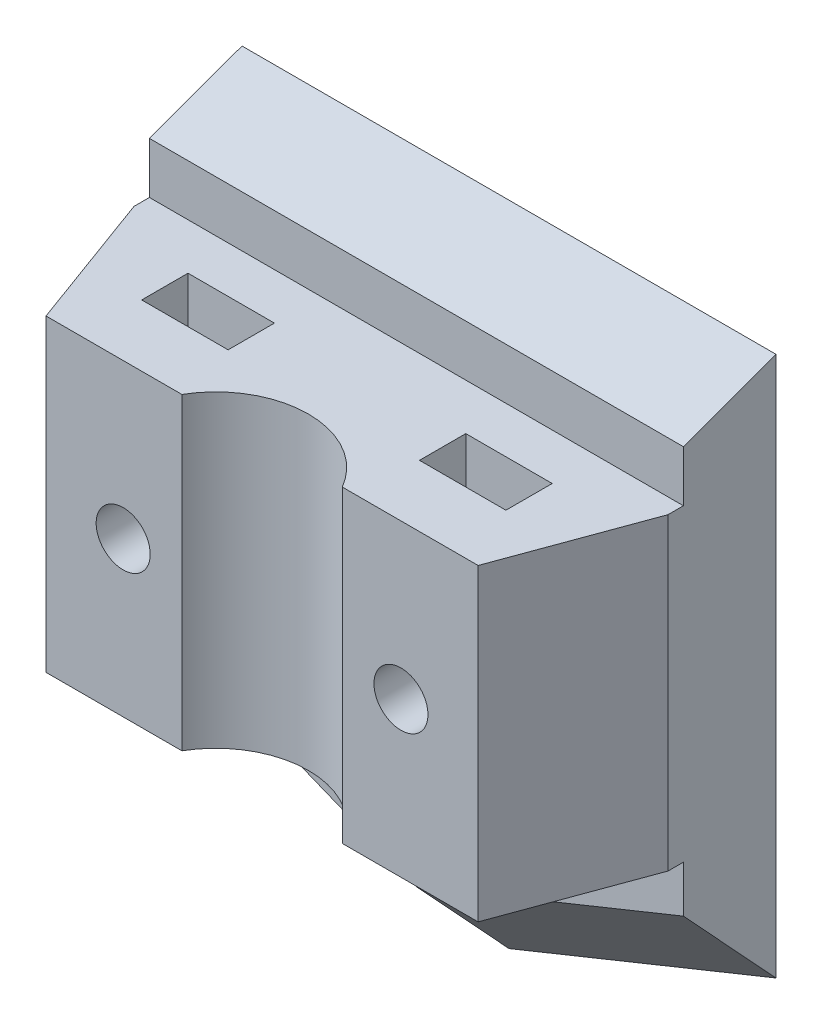
ISO-10303-21;
HEADER;
FILE_DESCRIPTION(('STEP AP214'),'2;1');
FILE_NAME('part.step','',(''),(''),'','','');
FILE_SCHEMA(('AUTOMOTIVE_DESIGN { 1 0 10303 214 1 1 1 1 }'));
ENDSEC;
DATA;
#1=APPLICATION_CONTEXT('core data for automotive mechanical design processes');
#2=APPLICATION_PROTOCOL_DEFINITION('international standard','automotive_design',2000,#1);
#3=PRODUCT_CONTEXT('',#1,'mechanical');
#4=PRODUCT('Part','Part','',(#3));
#5=PRODUCT_RELATED_PRODUCT_CATEGORY('part','',(#4));
#6=PRODUCT_DEFINITION_FORMATION('','',#4);
#7=PRODUCT_DEFINITION_CONTEXT('part definition',#1,'design');
#8=PRODUCT_DEFINITION('design','',#6,#7);
#9=PRODUCT_DEFINITION_SHAPE('','',#8);
#10=(LENGTH_UNIT() NAMED_UNIT(*) SI_UNIT(.MILLI.,.METRE.));
#11=(NAMED_UNIT(*) PLANE_ANGLE_UNIT() SI_UNIT($,.RADIAN.));
#12=(NAMED_UNIT(*) SI_UNIT($,.STERADIAN.) SOLID_ANGLE_UNIT());
#13=UNCERTAINTY_MEASURE_WITH_UNIT(LENGTH_MEASURE(1.E-05),#10,'distance_accuracy_value','');
#14=(GEOMETRIC_REPRESENTATION_CONTEXT(3) GLOBAL_UNCERTAINTY_ASSIGNED_CONTEXT((#13)) GLOBAL_UNIT_ASSIGNED_CONTEXT((#10,
#11,#12)) REPRESENTATION_CONTEXT('',''));
#15=CARTESIAN_POINT('',(0.,0.,0.));
#16=DIRECTION('',(0.,0.,1.));
#17=DIRECTION('',(1.,0.,0.));
#18=AXIS2_PLACEMENT_3D('',#15,#16,#17);
#19=CARTESIAN_POINT('',(0.,-26.5,0.));
#20=DIRECTION('',(0.265223828337456,0.655481747176855,-0.707106781186549));
#21=DIRECTION('',(-0.926991176745522,0.375083135099344,0.));
#22=AXIS2_PLACEMENT_3D('',#19,#20,#21);
#23=PLANE('',#22);
#24=DIRECTION('',(0.,0.733371095333155,0.679828534654032));
#25=VECTOR('',#24,1.);
#26=CARTESIAN_POINT('',(0.,-26.5,0.));
#27=LINE('',#26,#25);
#28=CARTESIAN_POINT('',(0.,-20.0274464843724,6.));
#29=VERTEX_POINT('',#28);
#30=CARTESIAN_POINT('',(0.,-26.5,0.));
#31=VERTEX_POINT('',#30);
#32=EDGE_CURVE('E334',#29,#31,#27,.F.);
#33=ORIENTED_EDGE('',*,*,#32,.F.);
#34=DIRECTION('',(0.926991176745522,-0.375083135099344,0.));
#35=VECTOR('',#34,1.);
#36=CARTESIAN_POINT('',(2.25049881059607,-20.9380529395268,6.));
#37=LINE('',#36,#35);
#38=CARTESIAN_POINT('',(-17.3,-13.0274464843724,6.));
#39=VERTEX_POINT('',#38);
#40=EDGE_CURVE('E199',#29,#39,#37,.F.);
#41=ORIENTED_EDGE('',*,*,#40,.T.);
#42=DIRECTION('',(0.,-0.733371095333155,-0.679828534654032));
#43=VECTOR('',#42,1.);
#44=CARTESIAN_POINT('',(-17.3,-23.2648321442911,-3.48996617968573));
#45=LINE('',#44,#43);
#46=CARTESIAN_POINT('',(-17.3,-19.5,0.));
#47=VERTEX_POINT('',#46);
#48=EDGE_CURVE('E350',#47,#39,#45,.F.);
#49=ORIENTED_EDGE('',*,*,#48,.F.);
#50=DIRECTION('',(-0.926991176745522,0.375083135099344,0.));
#51=VECTOR('',#50,1.);
#52=CARTESIAN_POINT('',(0.,-26.5,0.));
#53=LINE('',#52,#51);
#54=EDGE_CURVE('E335',#31,#47,#53,.T.);
#55=ORIENTED_EDGE('',*,*,#54,.F.);
#56=EDGE_LOOP('',(#33,#41,#49,#55));
#57=FACE_BOUND('',#56,.T.);
#58=ADVANCED_FACE('F34',(#57),#23,.F.);
#59=CARTESIAN_POINT('',(17.3,-19.5,0.));
#60=DIRECTION('',(-0.265223828337456,0.655481747176855,-0.707106781186549));
#61=DIRECTION('',(-0.926991176745522,-0.375083135099344,0.));
#62=AXIS2_PLACEMENT_3D('',#59,#60,#61);
#63=PLANE('',#62);
#64=DIRECTION('',(0.,0.733371095333155,0.679828534654032));
#65=VECTOR('',#64,1.);
#66=CARTESIAN_POINT('',(17.3,-19.5,0.));
#67=LINE('',#66,#65);
#68=CARTESIAN_POINT('',(17.3,-13.0274464843724,6.));
#69=VERTEX_POINT('',#68);
#70=CARTESIAN_POINT('',(17.3,-19.5,0.));
#71=VERTEX_POINT('',#70);
#72=EDGE_CURVE('E348',#69,#71,#67,.F.);
#73=ORIENTED_EDGE('',*,*,#72,.F.);
#74=DIRECTION('',(0.926991176745522,0.375083135099344,0.));
#75=VECTOR('',#74,1.);
#76=CARTESIAN_POINT('',(15.0495011894039,-13.9380529395268,6.));
#77=LINE('',#76,#75);
#78=EDGE_CURVE('E11',#69,#29,#77,.F.);
#79=ORIENTED_EDGE('',*,*,#78,.T.);
#80=ORIENTED_EDGE('',*,*,#32,.T.);
#81=DIRECTION('',(-0.926991176745522,-0.375083135099344,0.));
#82=VECTOR('',#81,1.);
#83=CARTESIAN_POINT('',(17.3,-19.5,0.));
#84=LINE('',#83,#82);
#85=EDGE_CURVE('E339',#71,#31,#84,.T.);
#86=ORIENTED_EDGE('',*,*,#85,.F.);
#87=EDGE_LOOP('',(#73,#79,#80,#86));
#88=FACE_BOUND('',#87,.T.);
#89=ADVANCED_FACE('F380',(#88),#63,.F.);
#90=CARTESIAN_POINT('',(17.3,13.,7.));
#91=DIRECTION('',(-1.,0.,0.));
#92=DIRECTION('',(0.,0.,1.));
#93=AXIS2_PLACEMENT_3D('',#90,#91,#92);
#94=PLANE('',#93);
#95=DIRECTION('',(0.,-1.,0.));
#96=VECTOR('',#95,1.);
#97=CARTESIAN_POINT('',(17.3,10.,7.));
#98=LINE('',#97,#96);
#99=CARTESIAN_POINT('',(17.3,10.,7.));
#100=VERTEX_POINT('',#99);
#101=CARTESIAN_POINT('',(17.3,-9.99999999999999,7.));
#102=VERTEX_POINT('',#101);
#103=EDGE_CURVE('E196',#100,#102,#98,.T.);
#104=ORIENTED_EDGE('',*,*,#103,.T.);
#105=DIRECTION('',(0.,0.,1.));
#106=VECTOR('',#105,1.);
#107=CARTESIAN_POINT('',(17.3,-9.99999999999999,6.));
#108=LINE('',#107,#106);
#109=CARTESIAN_POINT('',(17.3,-9.99999999999999,6.));
#110=VERTEX_POINT('',#109);
#111=EDGE_CURVE('E49',#110,#102,#108,.T.);
#112=ORIENTED_EDGE('',*,*,#111,.F.);
#113=DIRECTION('',(0.,1.,0.));
#114=VECTOR('',#113,1.);
#115=CARTESIAN_POINT('',(17.3,-9.99999999999999,6.));
#116=LINE('',#115,#114);
#117=EDGE_CURVE('E181',#69,#110,#116,.T.);
#118=ORIENTED_EDGE('',*,*,#117,.F.);
#119=ORIENTED_EDGE('',*,*,#72,.T.);
#120=DIRECTION('',(0.,1.,0.));
#121=VECTOR('',#120,1.);
#122=CARTESIAN_POINT('',(17.3,13.,0.));
#123=LINE('',#122,#121);
#124=CARTESIAN_POINT('',(17.3,15.5,0.));
#125=VERTEX_POINT('',#124);
#126=EDGE_CURVE('E344',#71,#125,#123,.T.);
#127=ORIENTED_EDGE('',*,*,#126,.T.);
#128=DIRECTION('',(0.,0.342020143325666,-0.939692620785909));
#129=VECTOR('',#128,1.);
#130=CARTESIAN_POINT('',(17.3,15.5,0.));
#131=LINE('',#130,#129);
#132=CARTESIAN_POINT('',(17.3,13.3161785944028,6.));
#133=VERTEX_POINT('',#132);
#134=EDGE_CURVE('E58',#125,#133,#131,.F.);
#135=ORIENTED_EDGE('',*,*,#134,.T.);
#136=DIRECTION('',(0.,1.,0.));
#137=VECTOR('',#136,1.);
#138=CARTESIAN_POINT('',(17.3,10.,6.));
#139=LINE('',#138,#137);
#140=CARTESIAN_POINT('',(17.3,10.,6.));
#141=VERTEX_POINT('',#140);
#142=EDGE_CURVE('E209',#141,#133,#139,.T.);
#143=ORIENTED_EDGE('',*,*,#142,.F.);
#144=DIRECTION('',(0.,0.,1.));
#145=VECTOR('',#144,1.);
#146=CARTESIAN_POINT('',(17.3,10.,6.));
#147=LINE('',#146,#145);
#148=EDGE_CURVE('E212',#141,#100,#147,.T.);
#149=ORIENTED_EDGE('',*,*,#148,.T.);
#150=EDGE_LOOP('',(#104,#112,#118,#119,#127,#135,#143,#149));
#151=FACE_BOUND('',#150,.T.);
#152=ADVANCED_FACE('F194',(#151),#94,.F.);
#153=CARTESIAN_POINT('',(-17.3,13.,7.));
#154=DIRECTION('',(1.,0.,0.));
#155=DIRECTION('',(0.,1.,0.));
#156=AXIS2_PLACEMENT_3D('',#153,#154,#155);
#157=PLANE('',#156);
#158=DIRECTION('',(0.,-1.,0.));
#159=VECTOR('',#158,1.);
#160=CARTESIAN_POINT('',(-17.3,-9.99999999999999,6.));
#161=LINE('',#160,#159);
#162=CARTESIAN_POINT('',(-17.3,-9.99999999999999,6.));
#163=VERTEX_POINT('',#162);
#164=EDGE_CURVE('E187',#163,#39,#161,.T.);
#165=ORIENTED_EDGE('',*,*,#164,.F.);
#166=DIRECTION('',(0.,0.,1.));
#167=VECTOR('',#166,1.);
#168=CARTESIAN_POINT('',(-17.3,-9.99999999999999,6.));
#169=LINE('',#168,#167);
#170=CARTESIAN_POINT('',(-17.3,-9.99999999999999,7.));
#171=VERTEX_POINT('',#170);
#172=EDGE_CURVE('E192',#163,#171,#169,.T.);
#173=ORIENTED_EDGE('',*,*,#172,.T.);
#174=DIRECTION('',(0.,-1.,0.));
#175=VECTOR('',#174,1.);
#176=CARTESIAN_POINT('',(-17.3,10.,7.));
#177=LINE('',#176,#175);
#178=CARTESIAN_POINT('',(-17.3,10.,7.));
#179=VERTEX_POINT('',#178);
#180=EDGE_CURVE('E331',#179,#171,#177,.T.);
#181=ORIENTED_EDGE('',*,*,#180,.F.);
#182=DIRECTION('',(0.,0.,1.));
#183=VECTOR('',#182,1.);
#184=CARTESIAN_POINT('',(-17.3,10.,6.));
#185=LINE('',#184,#183);
#186=CARTESIAN_POINT('',(-17.3,10.,6.));
#187=VERTEX_POINT('',#186);
#188=EDGE_CURVE('E211',#187,#179,#185,.T.);
#189=ORIENTED_EDGE('',*,*,#188,.F.);
#190=DIRECTION('',(0.,-1.,0.));
#191=VECTOR('',#190,1.);
#192=CARTESIAN_POINT('',(-17.3,10.,6.));
#193=LINE('',#192,#191);
#194=CARTESIAN_POINT('',(-17.3,13.3161785944028,6.));
#195=VERTEX_POINT('',#194);
#196=EDGE_CURVE('E204',#195,#187,#193,.T.);
#197=ORIENTED_EDGE('',*,*,#196,.F.);
#198=DIRECTION('',(0.,-0.342020143325666,0.939692620785909));
#199=VECTOR('',#198,1.);
#200=CARTESIAN_POINT('',(-17.3,15.5,0.));
#201=LINE('',#200,#199);
#202=CARTESIAN_POINT('',(-17.3,15.5,0.));
#203=VERTEX_POINT('',#202);
#204=EDGE_CURVE('E355',#195,#203,#201,.F.);
#205=ORIENTED_EDGE('',*,*,#204,.T.);
#206=DIRECTION('',(0.,-1.,0.));
#207=VECTOR('',#206,1.);
#208=CARTESIAN_POINT('',(-17.3,13.,0.));
#209=LINE('',#208,#207);
#210=EDGE_CURVE('E346',#203,#47,#209,.T.);
#211=ORIENTED_EDGE('',*,*,#210,.T.);
#212=ORIENTED_EDGE('',*,*,#48,.T.);
#213=EDGE_LOOP('',(#165,#173,#181,#189,#197,#205,#211,#212));
#214=FACE_BOUND('',#213,.T.);
#215=ADVANCED_FACE('F368',(#214),#157,.F.);
#216=CARTESIAN_POINT('',(0.,0.,0.));
#217=DIRECTION('',(0.,0.,1.));
#218=DIRECTION('',(1.,0.,0.));
#219=AXIS2_PLACEMENT_3D('',#216,#217,#218);
#220=PLANE('',#219);
#221=CARTESIAN_POINT('',(8.99999999999999,0.,0.));
#222=DIRECTION('',(0.,0.,1.));
#223=DIRECTION('',(1.,0.,0.));
#224=AXIS2_PLACEMENT_3D('',#221,#222,#223);
#225=CIRCLE('',#224,1.75);
#226=CARTESIAN_POINT('',(10.75,0.,0.));
#227=VERTEX_POINT('',#226);
#228=EDGE_CURVE('E222',#227,#227,#225,.T.);
#229=ORIENTED_EDGE('',*,*,#228,.T.);
#230=EDGE_LOOP('',(#229));
#231=FACE_BOUND('',#230,.T.);
#232=CARTESIAN_POINT('',(-9.00000000000001,0.,0.));
#233=DIRECTION('',(0.,0.,1.));
#234=DIRECTION('',(1.,0.,0.));
#235=AXIS2_PLACEMENT_3D('',#232,#233,#234);
#236=CIRCLE('',#235,1.75);
#237=CARTESIAN_POINT('',(-7.25000000000001,0.,0.));
#238=VERTEX_POINT('',#237);
#239=EDGE_CURVE('E232',#238,#238,#236,.T.);
#240=ORIENTED_EDGE('',*,*,#239,.T.);
#241=EDGE_LOOP('',(#240));
#242=FACE_BOUND('',#241,.T.);
#243=ORIENTED_EDGE('',*,*,#126,.F.);
#244=ORIENTED_EDGE('',*,*,#85,.T.);
#245=ORIENTED_EDGE('',*,*,#54,.T.);
#246=ORIENTED_EDGE('',*,*,#210,.F.);
#247=DIRECTION('',(1.,0.,0.));
#248=VECTOR('',#247,1.);
#249=CARTESIAN_POINT('',(17.3,15.5,0.));
#250=LINE('',#249,#248);
#251=EDGE_CURVE('E338',#203,#125,#250,.T.);
#252=ORIENTED_EDGE('',*,*,#251,.T.);
#253=EDGE_LOOP('',(#243,#244,#245,#246,#252));
#254=FACE_BOUND('',#253,.T.);
#255=ADVANCED_FACE('F373',(#231,#242,#254),#220,.F.);
#256=CARTESIAN_POINT('',(17.3,15.5,0.));
#257=DIRECTION('',(0.,-0.939692620785909,-0.342020143325666));
#258=DIRECTION('',(1.,0.,0.));
#259=AXIS2_PLACEMENT_3D('',#256,#257,#258);
#260=PLANE('',#259);
#261=DIRECTION('',(1.,0.,0.));
#262=VECTOR('',#261,1.);
#263=CARTESIAN_POINT('',(17.3,13.3161785944028,6.));
#264=LINE('',#263,#262);
#265=EDGE_CURVE('E42',#133,#195,#264,.F.);
#266=ORIENTED_EDGE('',*,*,#265,.F.);
#267=ORIENTED_EDGE('',*,*,#134,.F.);
#268=ORIENTED_EDGE('',*,*,#251,.F.);
#269=ORIENTED_EDGE('',*,*,#204,.F.);
#270=EDGE_LOOP('',(#266,#267,#268,#269));
#271=FACE_BOUND('',#270,.T.);
#272=ADVANCED_FACE('F36',(#271),#260,.F.);
#273=CARTESIAN_POINT('',(0.,10.,19.));
#274=DIRECTION('',(0.,1.,0.));
#275=DIRECTION('',(0.,0.,1.));
#276=AXIS2_PLACEMENT_3D('',#273,#274,#275);
#277=PLANE('',#276);
#278=DIRECTION('',(0.344254649158423,0.,-0.938876315886609));
#279=VECTOR('',#278,1.);
#280=CARTESIAN_POINT('',(17.3,10.,7.));
#281=LINE('',#280,#279);
#282=CARTESIAN_POINT('',(14.,10.,16.));
#283=VERTEX_POINT('',#282);
#284=EDGE_CURVE('E307',#283,#100,#281,.T.);
#285=ORIENTED_EDGE('',*,*,#284,.T.);
#286=ORIENTED_EDGE('',*,*,#148,.F.);
#287=DIRECTION('',(1.,0.,0.));
#288=VECTOR('',#287,1.);
#289=CARTESIAN_POINT('',(-17.3,10.,6.));
#290=LINE('',#289,#288);
#291=EDGE_CURVE('E206',#187,#141,#290,.T.);
#292=ORIENTED_EDGE('',*,*,#291,.F.);
#293=ORIENTED_EDGE('',*,*,#188,.T.);
#294=DIRECTION('',(0.344254649158423,0.,0.938876315886609));
#295=VECTOR('',#294,1.);
#296=CARTESIAN_POINT('',(-17.3,10.,7.));
#297=LINE('',#296,#295);
#298=CARTESIAN_POINT('',(-14.,10.,16.));
#299=VERTEX_POINT('',#298);
#300=EDGE_CURVE('E298',#179,#299,#297,.T.);
#301=ORIENTED_EDGE('',*,*,#300,.T.);
#302=DIRECTION('',(1.,0.,0.));
#303=VECTOR('',#302,1.);
#304=CARTESIAN_POINT('',(-14.,10.,16.));
#305=LINE('',#304,#303);
#306=CARTESIAN_POINT('',(-5.19615242270663,10.,16.));
#307=VERTEX_POINT('',#306);
#308=EDGE_CURVE('E300',#299,#307,#305,.T.);
#309=ORIENTED_EDGE('',*,*,#308,.T.);
#310=CARTESIAN_POINT('',(0.,10.,19.));
#311=DIRECTION('',(0.,-1.,0.));
#312=DIRECTION('',(0.,0.,1.));
#313=AXIS2_PLACEMENT_3D('',#310,#311,#312);
#314=CIRCLE('',#313,6.);
#315=CARTESIAN_POINT('',(5.19615242270664,10.,16.));
#316=VERTEX_POINT('',#315);
#317=EDGE_CURVE('E303',#307,#316,#314,.T.);
#318=ORIENTED_EDGE('',*,*,#317,.T.);
#319=DIRECTION('',(1.,0.,0.));
#320=VECTOR('',#319,1.);
#321=CARTESIAN_POINT('',(5.19615242270664,10.,16.));
#322=LINE('',#321,#320);
#323=EDGE_CURVE('E305',#316,#283,#322,.T.);
#324=ORIENTED_EDGE('',*,*,#323,.T.);
#325=EDGE_LOOP('',(#285,#286,#292,#293,#301,#309,#318,#324));
#326=FACE_BOUND('',#325,.T.);
#327=DIRECTION('',(-1.,0.,0.));
#328=VECTOR('',#327,1.);
#329=CARTESIAN_POINT('',(-11.8,10.,9.));
#330=LINE('',#329,#328);
#331=CARTESIAN_POINT('',(-6.2,10.,9.));
#332=VERTEX_POINT('',#331);
#333=CARTESIAN_POINT('',(-11.8,10.,9.));
#334=VERTEX_POINT('',#333);
#335=EDGE_CURVE('E269',#332,#334,#330,.T.);
#336=ORIENTED_EDGE('',*,*,#335,.F.);
#337=DIRECTION('',(0.,0.,-1.));
#338=VECTOR('',#337,1.);
#339=CARTESIAN_POINT('',(-6.2,10.,9.));
#340=LINE('',#339,#338);
#341=CARTESIAN_POINT('',(-6.2,10.,12.));
#342=VERTEX_POINT('',#341);
#343=EDGE_CURVE('E267',#342,#332,#340,.T.);
#344=ORIENTED_EDGE('',*,*,#343,.F.);
#345=DIRECTION('',(1.,0.,0.));
#346=VECTOR('',#345,1.);
#347=CARTESIAN_POINT('',(-11.8,10.,12.));
#348=LINE('',#347,#346);
#349=CARTESIAN_POINT('',(-11.8,10.,12.));
#350=VERTEX_POINT('',#349);
#351=EDGE_CURVE('E275',#350,#342,#348,.T.);
#352=ORIENTED_EDGE('',*,*,#351,.F.);
#353=DIRECTION('',(0.,0.,1.));
#354=VECTOR('',#353,1.);
#355=CARTESIAN_POINT('',(-11.8,10.,9.));
#356=LINE('',#355,#354);
#357=EDGE_CURVE('E272',#334,#350,#356,.T.);
#358=ORIENTED_EDGE('',*,*,#357,.F.);
#359=EDGE_LOOP('',(#336,#344,#352,#358));
#360=FACE_BOUND('',#359,.T.);
#361=DIRECTION('',(-1.,0.,0.));
#362=VECTOR('',#361,1.);
#363=CARTESIAN_POINT('',(11.8,10.,9.));
#364=LINE('',#363,#362);
#365=CARTESIAN_POINT('',(11.8,10.,9.));
#366=VERTEX_POINT('',#365);
#367=CARTESIAN_POINT('',(6.2,10.,9.));
#368=VERTEX_POINT('',#367);
#369=EDGE_CURVE('E238',#366,#368,#364,.T.);
#370=ORIENTED_EDGE('',*,*,#369,.F.);
#371=DIRECTION('',(0.,0.,-1.));
#372=VECTOR('',#371,1.);
#373=CARTESIAN_POINT('',(11.8,10.,9.));
#374=LINE('',#373,#372);
#375=CARTESIAN_POINT('',(11.8,10.,12.));
#376=VERTEX_POINT('',#375);
#377=EDGE_CURVE('E236',#376,#366,#374,.T.);
#378=ORIENTED_EDGE('',*,*,#377,.F.);
#379=DIRECTION('',(1.,0.,0.));
#380=VECTOR('',#379,1.);
#381=CARTESIAN_POINT('',(11.8,10.,12.));
#382=LINE('',#381,#380);
#383=CARTESIAN_POINT('',(6.2,10.,12.));
#384=VERTEX_POINT('',#383);
#385=EDGE_CURVE('E244',#384,#376,#382,.T.);
#386=ORIENTED_EDGE('',*,*,#385,.F.);
#387=DIRECTION('',(0.,0.,1.));
#388=VECTOR('',#387,1.);
#389=CARTESIAN_POINT('',(6.2,10.,9.));
#390=LINE('',#389,#388);
#391=EDGE_CURVE('E241',#368,#384,#390,.T.);
#392=ORIENTED_EDGE('',*,*,#391,.F.);
#393=EDGE_LOOP('',(#370,#378,#386,#392));
#394=FACE_BOUND('',#393,.T.);
#395=ADVANCED_FACE('F383',(#326,#360,#394),#277,.T.);
#396=CARTESIAN_POINT('',(0.,-10.,19.));
#397=DIRECTION('',(0.,1.,0.));
#398=DIRECTION('',(0.,0.,1.));
#399=AXIS2_PLACEMENT_3D('',#396,#397,#398);
#400=PLANE('',#399);
#401=DIRECTION('',(0.,0.,-1.));
#402=VECTOR('',#401,1.);
#403=CARTESIAN_POINT('',(-6.2,-10.,9.));
#404=LINE('',#403,#402);
#405=CARTESIAN_POINT('',(-6.2,-10.,12.));
#406=VERTEX_POINT('',#405);
#407=CARTESIAN_POINT('',(-6.2,-10.,9.));
#408=VERTEX_POINT('',#407);
#409=EDGE_CURVE('E266',#406,#408,#404,.T.);
#410=ORIENTED_EDGE('',*,*,#409,.T.);
#411=DIRECTION('',(-1.,0.,0.));
#412=VECTOR('',#411,1.);
#413=CARTESIAN_POINT('',(-11.8,-10.,9.));
#414=LINE('',#413,#412);
#415=CARTESIAN_POINT('',(-11.8,-10.,9.));
#416=VERTEX_POINT('',#415);
#417=EDGE_CURVE('E280',#408,#416,#414,.T.);
#418=ORIENTED_EDGE('',*,*,#417,.T.);
#419=DIRECTION('',(0.,0.,1.));
#420=VECTOR('',#419,1.);
#421=CARTESIAN_POINT('',(-11.8,-10.,9.));
#422=LINE('',#421,#420);
#423=CARTESIAN_POINT('',(-11.8,-10.,12.));
#424=VERTEX_POINT('',#423);
#425=EDGE_CURVE('E283',#416,#424,#422,.T.);
#426=ORIENTED_EDGE('',*,*,#425,.T.);
#427=DIRECTION('',(1.,0.,0.));
#428=VECTOR('',#427,1.);
#429=CARTESIAN_POINT('',(-11.8,-10.,12.));
#430=LINE('',#429,#428);
#431=EDGE_CURVE('E270',#424,#406,#430,.T.);
#432=ORIENTED_EDGE('',*,*,#431,.T.);
#433=EDGE_LOOP('',(#410,#418,#426,#432));
#434=FACE_BOUND('',#433,.T.);
#435=DIRECTION('',(0.344254649158423,0.,0.938876315886609));
#436=VECTOR('',#435,1.);
#437=CARTESIAN_POINT('',(-17.3,-10.,7.));
#438=LINE('',#437,#436);
#439=CARTESIAN_POINT('',(-14.,-10.,16.));
#440=VERTEX_POINT('',#439);
#441=EDGE_CURVE('E297',#171,#440,#438,.T.);
#442=ORIENTED_EDGE('',*,*,#441,.F.);
#443=ORIENTED_EDGE('',*,*,#172,.F.);
#444=DIRECTION('',(-1.,0.,0.));
#445=VECTOR('',#444,1.);
#446=CARTESIAN_POINT('',(-17.3,-9.99999999999999,6.));
#447=LINE('',#446,#445);
#448=EDGE_CURVE('E183',#110,#163,#447,.T.);
#449=ORIENTED_EDGE('',*,*,#448,.F.);
#450=ORIENTED_EDGE('',*,*,#111,.T.);
#451=DIRECTION('',(0.344254649158423,0.,-0.938876315886609));
#452=VECTOR('',#451,1.);
#453=CARTESIAN_POINT('',(17.3,-10.,7.));
#454=LINE('',#453,#452);
#455=CARTESIAN_POINT('',(14.,-10.,16.));
#456=VERTEX_POINT('',#455);
#457=EDGE_CURVE('E301',#456,#102,#454,.T.);
#458=ORIENTED_EDGE('',*,*,#457,.F.);
#459=DIRECTION('',(1.,0.,0.));
#460=VECTOR('',#459,1.);
#461=CARTESIAN_POINT('',(5.19615242270664,-10.,16.));
#462=LINE('',#461,#460);
#463=CARTESIAN_POINT('',(5.19615242270664,-10.,16.));
#464=VERTEX_POINT('',#463);
#465=EDGE_CURVE('E315',#464,#456,#462,.T.);
#466=ORIENTED_EDGE('',*,*,#465,.F.);
#467=CARTESIAN_POINT('',(0.,-10.,19.));
#468=DIRECTION('',(0.,-1.,0.));
#469=DIRECTION('',(0.,0.,1.));
#470=AXIS2_PLACEMENT_3D('',#467,#468,#469);
#471=CIRCLE('',#470,6.);
#472=CARTESIAN_POINT('',(-5.19615242270663,-10.,16.));
#473=VERTEX_POINT('',#472);
#474=EDGE_CURVE('E313',#473,#464,#471,.T.);
#475=ORIENTED_EDGE('',*,*,#474,.F.);
#476=DIRECTION('',(1.,0.,0.));
#477=VECTOR('',#476,1.);
#478=CARTESIAN_POINT('',(-14.,-10.,16.));
#479=LINE('',#478,#477);
#480=EDGE_CURVE('E311',#440,#473,#479,.T.);
#481=ORIENTED_EDGE('',*,*,#480,.F.);
#482=EDGE_LOOP('',(#442,#443,#449,#450,#458,#466,#475,#481));
#483=FACE_BOUND('',#482,.T.);
#484=DIRECTION('',(0.,0.,-1.));
#485=VECTOR('',#484,1.);
#486=CARTESIAN_POINT('',(11.8,-10.,9.));
#487=LINE('',#486,#485);
#488=CARTESIAN_POINT('',(11.8,-10.,12.));
#489=VERTEX_POINT('',#488);
#490=CARTESIAN_POINT('',(11.8,-10.,9.));
#491=VERTEX_POINT('',#490);
#492=EDGE_CURVE('E235',#489,#491,#487,.T.);
#493=ORIENTED_EDGE('',*,*,#492,.T.);
#494=DIRECTION('',(-1.,0.,0.));
#495=VECTOR('',#494,1.);
#496=CARTESIAN_POINT('',(11.8,-10.,9.));
#497=LINE('',#496,#495);
#498=CARTESIAN_POINT('',(6.2,-10.,9.));
#499=VERTEX_POINT('',#498);
#500=EDGE_CURVE('E249',#491,#499,#497,.T.);
#501=ORIENTED_EDGE('',*,*,#500,.T.);
#502=DIRECTION('',(0.,0.,1.));
#503=VECTOR('',#502,1.);
#504=CARTESIAN_POINT('',(6.2,-10.,9.));
#505=LINE('',#504,#503);
#506=CARTESIAN_POINT('',(6.2,-10.,12.));
#507=VERTEX_POINT('',#506);
#508=EDGE_CURVE('E252',#499,#507,#505,.T.);
#509=ORIENTED_EDGE('',*,*,#508,.T.);
#510=DIRECTION('',(1.,0.,0.));
#511=VECTOR('',#510,1.);
#512=CARTESIAN_POINT('',(11.8,-10.,12.));
#513=LINE('',#512,#511);
#514=EDGE_CURVE('E239',#507,#489,#513,.T.);
#515=ORIENTED_EDGE('',*,*,#514,.T.);
#516=EDGE_LOOP('',(#493,#501,#509,#515));
#517=FACE_BOUND('',#516,.T.);
#518=ADVANCED_FACE('F190',(#434,#483,#517),#400,.F.);
#519=CARTESIAN_POINT('',(-17.3,10.,7.));
#520=DIRECTION('',(0.938876315886609,0.,-0.344254649158423));
#521=DIRECTION('',(-0.344254649158423,0.,-0.938876315886609));
#522=AXIS2_PLACEMENT_3D('',#519,#520,#521);
#523=PLANE('',#522);
#524=ORIENTED_EDGE('',*,*,#441,.T.);
#525=DIRECTION('',(0.,-1.,0.));
#526=VECTOR('',#525,1.);
#527=CARTESIAN_POINT('',(-14.,10.,16.));
#528=LINE('',#527,#526);
#529=EDGE_CURVE('E328',#299,#440,#528,.T.);
#530=ORIENTED_EDGE('',*,*,#529,.F.);
#531=ORIENTED_EDGE('',*,*,#300,.F.);
#532=ORIENTED_EDGE('',*,*,#180,.T.);
#533=EDGE_LOOP('',(#524,#530,#531,#532));
#534=FACE_BOUND('',#533,.T.);
#535=ADVANCED_FACE('F405',(#534),#523,.F.);
#536=CARTESIAN_POINT('',(-14.,10.,16.));
#537=DIRECTION('',(0.,0.,-1.));
#538=DIRECTION('',(-1.,0.,0.));
#539=AXIS2_PLACEMENT_3D('',#536,#537,#538);
#540=PLANE('',#539);
#541=CARTESIAN_POINT('',(-9.00000000000001,0.,16.));
#542=DIRECTION('',(0.,0.,1.));
#543=DIRECTION('',(1.,0.,0.));
#544=AXIS2_PLACEMENT_3D('',#541,#542,#543);
#545=CIRCLE('',#544,1.75);
#546=CARTESIAN_POINT('',(-7.25000000000001,0.,16.));
#547=VERTEX_POINT('',#546);
#548=EDGE_CURVE('E225',#547,#547,#545,.T.);
#549=ORIENTED_EDGE('',*,*,#548,.F.);
#550=EDGE_LOOP('',(#549));
#551=FACE_BOUND('',#550,.T.);
#552=ORIENTED_EDGE('',*,*,#480,.T.);
#553=DIRECTION('',(0.,-1.,0.));
#554=VECTOR('',#553,1.);
#555=CARTESIAN_POINT('',(-5.19615242270663,10.,16.));
#556=LINE('',#555,#554);
#557=EDGE_CURVE('E325',#307,#473,#556,.T.);
#558=ORIENTED_EDGE('',*,*,#557,.F.);
#559=ORIENTED_EDGE('',*,*,#308,.F.);
#560=ORIENTED_EDGE('',*,*,#529,.T.);
#561=EDGE_LOOP('',(#552,#558,#559,#560));
#562=FACE_BOUND('',#561,.T.);
#563=ADVANCED_FACE('F401',(#551,#562),#540,.F.);
#564=CARTESIAN_POINT('',(0.,10.,19.));
#565=DIRECTION('',(0.,-1.,0.));
#566=DIRECTION('',(0.,0.,-1.));
#567=AXIS2_PLACEMENT_3D('',#564,#565,#566);
#568=CYLINDRICAL_SURFACE('',#567,6.);
#569=ORIENTED_EDGE('',*,*,#474,.T.);
#570=DIRECTION('',(0.,-1.,0.));
#571=VECTOR('',#570,1.);
#572=CARTESIAN_POINT('',(5.19615242270664,10.,16.));
#573=LINE('',#572,#571);
#574=EDGE_CURVE('E322',#316,#464,#573,.T.);
#575=ORIENTED_EDGE('',*,*,#574,.F.);
#576=ORIENTED_EDGE('',*,*,#317,.F.);
#577=ORIENTED_EDGE('',*,*,#557,.T.);
#578=EDGE_LOOP('',(#569,#575,#576,#577));
#579=FACE_BOUND('',#578,.T.);
#580=ADVANCED_FACE('F397',(#579),#568,.F.);
#581=CARTESIAN_POINT('',(5.19615242270664,10.,16.));
#582=DIRECTION('',(0.,0.,-1.));
#583=DIRECTION('',(-1.,0.,0.));
#584=AXIS2_PLACEMENT_3D('',#581,#582,#583);
#585=PLANE('',#584);
#586=CARTESIAN_POINT('',(8.99999999999999,0.,16.));
#587=DIRECTION('',(0.,0.,1.));
#588=DIRECTION('',(-1.,0.,0.));
#589=AXIS2_PLACEMENT_3D('',#586,#587,#588);
#590=CIRCLE('',#589,1.75);
#591=CARTESIAN_POINT('',(7.24999999999999,0.,16.));
#592=VERTEX_POINT('',#591);
#593=EDGE_CURVE('E214',#592,#592,#590,.T.);
#594=ORIENTED_EDGE('',*,*,#593,.F.);
#595=EDGE_LOOP('',(#594));
#596=FACE_BOUND('',#595,.T.);
#597=ORIENTED_EDGE('',*,*,#465,.T.);
#598=DIRECTION('',(0.,-1.,0.));
#599=VECTOR('',#598,1.);
#600=CARTESIAN_POINT('',(14.,10.,16.));
#601=LINE('',#600,#599);
#602=EDGE_CURVE('E319',#283,#456,#601,.T.);
#603=ORIENTED_EDGE('',*,*,#602,.F.);
#604=ORIENTED_EDGE('',*,*,#323,.F.);
#605=ORIENTED_EDGE('',*,*,#574,.T.);
#606=EDGE_LOOP('',(#597,#603,#604,#605));
#607=FACE_BOUND('',#606,.T.);
#608=ADVANCED_FACE('F393',(#596,#607),#585,.F.);
#609=CARTESIAN_POINT('',(17.3,10.,7.));
#610=DIRECTION('',(-0.938876315886609,0.,-0.344254649158423));
#611=DIRECTION('',(-0.344254649158423,0.,0.938876315886609));
#612=AXIS2_PLACEMENT_3D('',#609,#610,#611);
#613=PLANE('',#612);
#614=ORIENTED_EDGE('',*,*,#457,.T.);
#615=ORIENTED_EDGE('',*,*,#103,.F.);
#616=ORIENTED_EDGE('',*,*,#284,.F.);
#617=ORIENTED_EDGE('',*,*,#602,.T.);
#618=EDGE_LOOP('',(#614,#615,#616,#617));
#619=FACE_BOUND('',#618,.T.);
#620=ADVANCED_FACE('F388',(#619),#613,.F.);
#621=CARTESIAN_POINT('',(-6.2,10.,9.));
#622=DIRECTION('',(-1.,0.,0.));
#623=DIRECTION('',(0.,0.,1.));
#624=AXIS2_PLACEMENT_3D('',#621,#622,#623);
#625=PLANE('',#624);
#626=ORIENTED_EDGE('',*,*,#409,.F.);
#627=DIRECTION('',(0.,-1.,0.));
#628=VECTOR('',#627,1.);
#629=CARTESIAN_POINT('',(-6.2,10.,12.));
#630=LINE('',#629,#628);
#631=EDGE_CURVE('E277',#342,#406,#630,.T.);
#632=ORIENTED_EDGE('',*,*,#631,.F.);
#633=ORIENTED_EDGE('',*,*,#343,.T.);
#634=DIRECTION('',(0.,-1.,0.));
#635=VECTOR('',#634,1.);
#636=CARTESIAN_POINT('',(-6.2,10.,9.));
#637=LINE('',#636,#635);
#638=EDGE_CURVE('E294',#332,#408,#637,.T.);
#639=ORIENTED_EDGE('',*,*,#638,.T.);
#640=EDGE_LOOP('',(#626,#632,#633,#639));
#641=FACE_BOUND('',#640,.T.);
#642=ADVANCED_FACE('F478',(#641),#625,.T.);
#643=CARTESIAN_POINT('',(-11.8,10.,9.));
#644=DIRECTION('',(0.,0.,1.));
#645=DIRECTION('',(1.,0.,0.));
#646=AXIS2_PLACEMENT_3D('',#643,#644,#645);
#647=PLANE('',#646);
#648=CARTESIAN_POINT('',(-9.00000000000001,0.,9.));
#649=DIRECTION('',(0.,0.,1.));
#650=DIRECTION('',(1.,0.,0.));
#651=AXIS2_PLACEMENT_3D('',#648,#649,#650);
#652=CIRCLE('',#651,1.75);
#653=CARTESIAN_POINT('',(-7.25000000000001,0.,9.));
#654=VERTEX_POINT('',#653);
#655=EDGE_CURVE('E229',#654,#654,#652,.T.);
#656=ORIENTED_EDGE('',*,*,#655,.F.);
#657=EDGE_LOOP('',(#656));
#658=FACE_BOUND('',#657,.T.);
#659=ORIENTED_EDGE('',*,*,#417,.F.);
#660=ORIENTED_EDGE('',*,*,#638,.F.);
#661=ORIENTED_EDGE('',*,*,#335,.T.);
#662=DIRECTION('',(0.,-1.,0.));
#663=VECTOR('',#662,1.);
#664=CARTESIAN_POINT('',(-11.8,10.,9.));
#665=LINE('',#664,#663);
#666=EDGE_CURVE('E292',#334,#416,#665,.T.);
#667=ORIENTED_EDGE('',*,*,#666,.T.);
#668=EDGE_LOOP('',(#659,#660,#661,#667));
#669=FACE_BOUND('',#668,.T.);
#670=ADVANCED_FACE('F474',(#658,#669),#647,.T.);
#671=CARTESIAN_POINT('',(-11.8,10.,9.));
#672=DIRECTION('',(1.,0.,0.));
#673=DIRECTION('',(0.,0.,-1.));
#674=AXIS2_PLACEMENT_3D('',#671,#672,#673);
#675=PLANE('',#674);
#676=ORIENTED_EDGE('',*,*,#425,.F.);
#677=ORIENTED_EDGE('',*,*,#666,.F.);
#678=ORIENTED_EDGE('',*,*,#357,.T.);
#679=DIRECTION('',(0.,-1.,0.));
#680=VECTOR('',#679,1.);
#681=CARTESIAN_POINT('',(-11.8,10.,12.));
#682=LINE('',#681,#680);
#683=EDGE_CURVE('E290',#350,#424,#682,.T.);
#684=ORIENTED_EDGE('',*,*,#683,.T.);
#685=EDGE_LOOP('',(#676,#677,#678,#684));
#686=FACE_BOUND('',#685,.T.);
#687=ADVANCED_FACE('F470',(#686),#675,.T.);
#688=CARTESIAN_POINT('',(-11.8,10.,12.));
#689=DIRECTION('',(0.,0.,-1.));
#690=DIRECTION('',(-1.,0.,0.));
#691=AXIS2_PLACEMENT_3D('',#688,#689,#690);
#692=PLANE('',#691);
#693=CARTESIAN_POINT('',(-9.00000000000001,0.,12.));
#694=DIRECTION('',(0.,0.,-1.));
#695=DIRECTION('',(-1.,0.,0.));
#696=AXIS2_PLACEMENT_3D('',#693,#694,#695);
#697=CIRCLE('',#696,1.75);
#698=CARTESIAN_POINT('',(-10.75,0.,12.));
#699=VERTEX_POINT('',#698);
#700=EDGE_CURVE('E228',#699,#699,#697,.T.);
#701=ORIENTED_EDGE('',*,*,#700,.F.);
#702=EDGE_LOOP('',(#701));
#703=FACE_BOUND('',#702,.T.);
#704=ORIENTED_EDGE('',*,*,#431,.F.);
#705=ORIENTED_EDGE('',*,*,#683,.F.);
#706=ORIENTED_EDGE('',*,*,#351,.T.);
#707=ORIENTED_EDGE('',*,*,#631,.T.);
#708=EDGE_LOOP('',(#704,#705,#706,#707));
#709=FACE_BOUND('',#708,.T.);
#710=ADVANCED_FACE('F466',(#703,#709),#692,.T.);
#711=CARTESIAN_POINT('',(11.8,10.,9.));
#712=DIRECTION('',(-1.,0.,0.));
#713=DIRECTION('',(0.,0.,1.));
#714=AXIS2_PLACEMENT_3D('',#711,#712,#713);
#715=PLANE('',#714);
#716=ORIENTED_EDGE('',*,*,#492,.F.);
#717=DIRECTION('',(0.,-1.,0.));
#718=VECTOR('',#717,1.);
#719=CARTESIAN_POINT('',(11.8,10.,12.));
#720=LINE('',#719,#718);
#721=EDGE_CURVE('E246',#376,#489,#720,.T.);
#722=ORIENTED_EDGE('',*,*,#721,.F.);
#723=ORIENTED_EDGE('',*,*,#377,.T.);
#724=DIRECTION('',(0.,-1.,0.));
#725=VECTOR('',#724,1.);
#726=CARTESIAN_POINT('',(11.8,10.,9.));
#727=LINE('',#726,#725);
#728=EDGE_CURVE('E263',#366,#491,#727,.T.);
#729=ORIENTED_EDGE('',*,*,#728,.T.);
#730=EDGE_LOOP('',(#716,#722,#723,#729));
#731=FACE_BOUND('',#730,.T.);
#732=ADVANCED_FACE('F462',(#731),#715,.T.);
#733=CARTESIAN_POINT('',(11.8,10.,9.));
#734=DIRECTION('',(0.,0.,1.));
#735=DIRECTION('',(1.,0.,0.));
#736=AXIS2_PLACEMENT_3D('',#733,#734,#735);
#737=PLANE('',#736);
#738=CARTESIAN_POINT('',(8.99999999999999,0.,9.));
#739=DIRECTION('',(0.,0.,1.));
#740=DIRECTION('',(1.,0.,0.));
#741=AXIS2_PLACEMENT_3D('',#738,#739,#740);
#742=CIRCLE('',#741,1.75);
#743=CARTESIAN_POINT('',(10.75,0.,9.));
#744=VERTEX_POINT('',#743);
#745=EDGE_CURVE('E219',#744,#744,#742,.T.);
#746=ORIENTED_EDGE('',*,*,#745,.F.);
#747=EDGE_LOOP('',(#746));
#748=FACE_BOUND('',#747,.T.);
#749=ORIENTED_EDGE('',*,*,#500,.F.);
#750=ORIENTED_EDGE('',*,*,#728,.F.);
#751=ORIENTED_EDGE('',*,*,#369,.T.);
#752=DIRECTION('',(0.,-1.,0.));
#753=VECTOR('',#752,1.);
#754=CARTESIAN_POINT('',(6.2,10.,9.));
#755=LINE('',#754,#753);
#756=EDGE_CURVE('E261',#368,#499,#755,.T.);
#757=ORIENTED_EDGE('',*,*,#756,.T.);
#758=EDGE_LOOP('',(#749,#750,#751,#757));
#759=FACE_BOUND('',#758,.T.);
#760=ADVANCED_FACE('F458',(#748,#759),#737,.T.);
#761=CARTESIAN_POINT('',(6.2,10.,9.));
#762=DIRECTION('',(1.,0.,0.));
#763=DIRECTION('',(0.,0.,-1.));
#764=AXIS2_PLACEMENT_3D('',#761,#762,#763);
#765=PLANE('',#764);
#766=ORIENTED_EDGE('',*,*,#508,.F.);
#767=ORIENTED_EDGE('',*,*,#756,.F.);
#768=ORIENTED_EDGE('',*,*,#391,.T.);
#769=DIRECTION('',(0.,-1.,0.));
#770=VECTOR('',#769,1.);
#771=CARTESIAN_POINT('',(6.2,10.,12.));
#772=LINE('',#771,#770);
#773=EDGE_CURVE('E259',#384,#507,#772,.T.);
#774=ORIENTED_EDGE('',*,*,#773,.T.);
#775=EDGE_LOOP('',(#766,#767,#768,#774));
#776=FACE_BOUND('',#775,.T.);
#777=ADVANCED_FACE('F454',(#776),#765,.T.);
#778=CARTESIAN_POINT('',(11.8,10.,12.));
#779=DIRECTION('',(0.,0.,-1.));
#780=DIRECTION('',(-1.,0.,0.));
#781=AXIS2_PLACEMENT_3D('',#778,#779,#780);
#782=PLANE('',#781);
#783=CARTESIAN_POINT('',(8.99999999999999,0.,12.));
#784=DIRECTION('',(0.,0.,-1.));
#785=DIRECTION('',(-1.,0.,0.));
#786=AXIS2_PLACEMENT_3D('',#783,#784,#785);
#787=CIRCLE('',#786,1.75);
#788=CARTESIAN_POINT('',(7.24999999999999,0.,12.));
#789=VERTEX_POINT('',#788);
#790=EDGE_CURVE('E218',#789,#789,#787,.T.);
#791=ORIENTED_EDGE('',*,*,#790,.F.);
#792=EDGE_LOOP('',(#791));
#793=FACE_BOUND('',#792,.T.);
#794=ORIENTED_EDGE('',*,*,#514,.F.);
#795=ORIENTED_EDGE('',*,*,#773,.F.);
#796=ORIENTED_EDGE('',*,*,#385,.T.);
#797=ORIENTED_EDGE('',*,*,#721,.T.);
#798=EDGE_LOOP('',(#794,#795,#796,#797));
#799=FACE_BOUND('',#798,.T.);
#800=ADVANCED_FACE('F448',(#793,#799),#782,.T.);
#801=CARTESIAN_POINT('',(-9.00000000000001,0.,-3.99999999999999));
#802=DIRECTION('',(0.,0.,1.));
#803=DIRECTION('',(1.,0.,0.));
#804=AXIS2_PLACEMENT_3D('',#801,#802,#803);
#805=CYLINDRICAL_SURFACE('',#804,1.75);
#806=ORIENTED_EDGE('',*,*,#700,.T.);
#807=EDGE_LOOP('',(#806));
#808=FACE_BOUND('',#807,.T.);
#809=ORIENTED_EDGE('',*,*,#548,.T.);
#810=EDGE_LOOP('',(#809));
#811=FACE_BOUND('',#810,.T.);
#812=ADVANCED_FACE('F438',(#808,#811),#805,.F.);
#813=ORIENTED_EDGE('',*,*,#655,.T.);
#814=EDGE_LOOP('',(#813));
#815=FACE_BOUND('',#814,.T.);
#816=ORIENTED_EDGE('',*,*,#239,.F.);
#817=EDGE_LOOP('',(#816));
#818=FACE_BOUND('',#817,.T.);
#819=ADVANCED_FACE('F435',(#815,#818),#805,.F.);
#820=CARTESIAN_POINT('',(8.99999999999999,0.,-3.99999999999999));
#821=DIRECTION('',(0.,0.,1.));
#822=DIRECTION('',(1.,0.,0.));
#823=AXIS2_PLACEMENT_3D('',#820,#821,#822);
#824=CYLINDRICAL_SURFACE('',#823,1.75);
#825=ORIENTED_EDGE('',*,*,#790,.T.);
#826=EDGE_LOOP('',(#825));
#827=FACE_BOUND('',#826,.T.);
#828=ORIENTED_EDGE('',*,*,#593,.T.);
#829=EDGE_LOOP('',(#828));
#830=FACE_BOUND('',#829,.T.);
#831=ADVANCED_FACE('F437',(#827,#830),#824,.F.);
#832=ORIENTED_EDGE('',*,*,#745,.T.);
#833=EDGE_LOOP('',(#832));
#834=FACE_BOUND('',#833,.T.);
#835=ORIENTED_EDGE('',*,*,#228,.F.);
#836=EDGE_LOOP('',(#835));
#837=FACE_BOUND('',#836,.T.);
#838=ADVANCED_FACE('F445',(#834,#837),#824,.F.);
#839=CARTESIAN_POINT('',(0.,0.,6.));
#840=DIRECTION('',(0.,0.,-1.));
#841=DIRECTION('',(-1.,0.,0.));
#842=AXIS2_PLACEMENT_3D('',#839,#840,#841);
#843=PLANE('',#842);
#844=ORIENTED_EDGE('',*,*,#265,.T.);
#845=ORIENTED_EDGE('',*,*,#196,.T.);
#846=ORIENTED_EDGE('',*,*,#291,.T.);
#847=ORIENTED_EDGE('',*,*,#142,.T.);
#848=EDGE_LOOP('',(#844,#845,#846,#847));
#849=FACE_BOUND('',#848,.T.);
#850=ADVANCED_FACE('F362',(#849),#843,.F.);
#851=CARTESIAN_POINT('',(0.,0.,6.));
#852=DIRECTION('',(0.,0.,1.));
#853=DIRECTION('',(1.,0.,0.));
#854=AXIS2_PLACEMENT_3D('',#851,#852,#853);
#855=PLANE('',#854);
#856=ORIENTED_EDGE('',*,*,#78,.F.);
#857=ORIENTED_EDGE('',*,*,#117,.T.);
#858=ORIENTED_EDGE('',*,*,#448,.T.);
#859=ORIENTED_EDGE('',*,*,#164,.T.);
#860=ORIENTED_EDGE('',*,*,#40,.F.);
#861=EDGE_LOOP('',(#856,#857,#858,#859,#860));
#862=FACE_BOUND('',#861,.T.);
#863=ADVANCED_FACE('F182',(#862),#855,.T.);
#864=CLOSED_SHELL('',(#58,#89,#152,#215,#255,#272,#395,#518,#535,#563,#580,#608,#620,#642,#670,
#687,#710,#732,#760,#777,#800,#812,#819,#831,#838,#850,#863));
#865=MANIFOLD_SOLID_BREP('B2',#864);
#866=ADVANCED_BREP_SHAPE_REPRESENTATION('',(#18,#865),#14);
#867=SHAPE_DEFINITION_REPRESENTATION(#9,#866);
ENDSEC;
END-ISO-10303-21;
